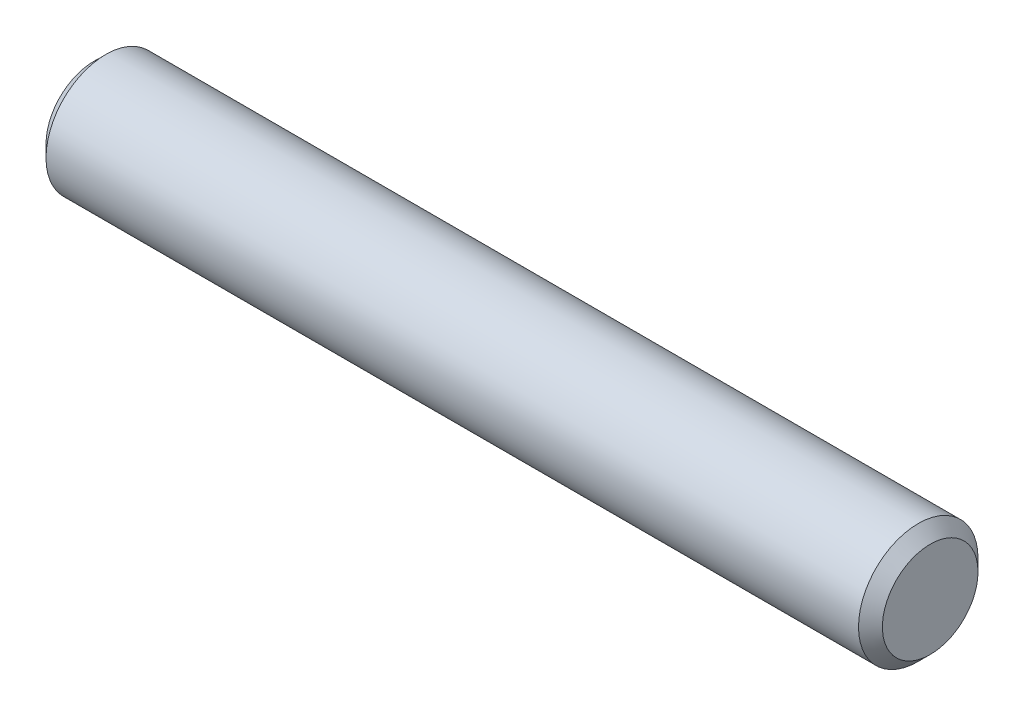
ISO-10303-21;
HEADER;
FILE_DESCRIPTION(('STEP AP214'),'2;1');
FILE_NAME('part.step','',(''),(''),'','','');
FILE_SCHEMA(('AUTOMOTIVE_DESIGN { 1 0 10303 214 1 1 1 1 }'));
ENDSEC;
DATA;
#1=APPLICATION_CONTEXT('core data for automotive mechanical design processes');
#2=APPLICATION_PROTOCOL_DEFINITION('international standard','automotive_design',2000,#1);
#3=PRODUCT_CONTEXT('',#1,'mechanical');
#4=PRODUCT('Part','Part','',(#3));
#5=PRODUCT_RELATED_PRODUCT_CATEGORY('part','',(#4));
#6=PRODUCT_DEFINITION_FORMATION('','',#4);
#7=PRODUCT_DEFINITION_CONTEXT('part definition',#1,'design');
#8=PRODUCT_DEFINITION('design','',#6,#7);
#9=PRODUCT_DEFINITION_SHAPE('','',#8);
#10=(LENGTH_UNIT() NAMED_UNIT(*) SI_UNIT(.MILLI.,.METRE.));
#11=(NAMED_UNIT(*) PLANE_ANGLE_UNIT() SI_UNIT($,.RADIAN.));
#12=(NAMED_UNIT(*) SI_UNIT($,.STERADIAN.) SOLID_ANGLE_UNIT());
#13=UNCERTAINTY_MEASURE_WITH_UNIT(LENGTH_MEASURE(1.E-05),#10,'distance_accuracy_value','');
#14=(GEOMETRIC_REPRESENTATION_CONTEXT(3) GLOBAL_UNCERTAINTY_ASSIGNED_CONTEXT((#13)) GLOBAL_UNIT_ASSIGNED_CONTEXT((#10,
#11,#12)) REPRESENTATION_CONTEXT('',''));
#15=CARTESIAN_POINT('',(0.,0.,0.));
#16=DIRECTION('',(0.,0.,1.));
#17=DIRECTION('',(1.,0.,0.));
#18=AXIS2_PLACEMENT_3D('',#15,#16,#17);
#19=CARTESIAN_POINT('',(22.225,0.,0.));
#20=DIRECTION('',(1.,0.,0.));
#21=DIRECTION('',(0.,1.,0.));
#22=AXIS2_PLACEMENT_3D('',#19,#20,#21);
#23=PLANE('',#22);
#24=CARTESIAN_POINT('',(22.225,0.,0.));
#25=DIRECTION('',(1.,0.,0.));
#26=DIRECTION('',(0.,0.,-1.));
#27=AXIS2_PLACEMENT_3D('',#24,#25,#26);
#28=CIRCLE('',#27,2.54);
#29=CARTESIAN_POINT('',(22.225,0.,-2.54));
#30=VERTEX_POINT('',#29);
#31=EDGE_CURVE('E25',#30,#30,#28,.T.);
#32=ORIENTED_EDGE('',*,*,#31,.T.);
#33=EDGE_LOOP('',(#32));
#34=FACE_BOUND('',#33,.T.);
#35=ADVANCED_FACE('F17',(#34),#23,.T.);
#36=CARTESIAN_POINT('',(-22.225,0.,0.));
#37=DIRECTION('',(1.,0.,0.));
#38=DIRECTION('',(0.,1.,0.));
#39=AXIS2_PLACEMENT_3D('',#36,#37,#38);
#40=PLANE('',#39);
#41=CARTESIAN_POINT('',(-22.225,0.,0.));
#42=DIRECTION('',(-1.,0.,0.));
#43=DIRECTION('',(0.,0.,-1.));
#44=AXIS2_PLACEMENT_3D('',#41,#42,#43);
#45=CIRCLE('',#44,2.54);
#46=CARTESIAN_POINT('',(-22.225,0.,2.54));
#47=VERTEX_POINT('',#46);
#48=EDGE_CURVE('E69',#47,#47,#45,.T.);
#49=ORIENTED_EDGE('',*,*,#48,.T.);
#50=EDGE_LOOP('',(#49));
#51=FACE_BOUND('',#50,.T.);
#52=ADVANCED_FACE('F136',(#51),#40,.F.);
#53=CARTESIAN_POINT('',(-22.225,0.,0.));
#54=DIRECTION('',(1.,0.,0.));
#55=DIRECTION('',(0.,0.,-1.));
#56=AXIS2_PLACEMENT_3D('',#53,#54,#55);
#57=CYLINDRICAL_SURFACE('',#56,3.175);
#58=CARTESIAN_POINT('',(21.59,0.,0.));
#59=DIRECTION('',(-1.,0.,0.));
#60=DIRECTION('',(0.,0.,-1.));
#61=AXIS2_PLACEMENT_3D('',#58,#59,#60);
#62=CIRCLE('',#61,3.175);
#63=CARTESIAN_POINT('',(21.59,0.,3.175));
#64=VERTEX_POINT('',#63);
#65=CARTESIAN_POINT('',(21.59,0.,-3.175));
#66=VERTEX_POINT('',#65);
#67=EDGE_CURVE('E77',#64,#66,#62,.T.);
#68=ORIENTED_EDGE('',*,*,#67,.T.);
#69=CARTESIAN_POINT('',(21.59,0.,0.));
#70=DIRECTION('',(-1.,0.,0.));
#71=DIRECTION('',(0.,0.,-1.));
#72=AXIS2_PLACEMENT_3D('',#69,#70,#71);
#73=CIRCLE('',#72,3.175);
#74=EDGE_CURVE('E63',#66,#64,#73,.T.);
#75=ORIENTED_EDGE('',*,*,#74,.T.);
#76=DIRECTION('',(-1.,0.,0.));
#77=VECTOR('',#76,1.);
#78=CARTESIAN_POINT('',(-22.225,0.,3.175));
#79=LINE('',#78,#77);
#80=CARTESIAN_POINT('',(-21.59,0.,3.175));
#81=VERTEX_POINT('',#80);
#82=EDGE_CURVE('E11',#64,#81,#79,.T.);
#83=ORIENTED_EDGE('',*,*,#82,.T.);
#84=CARTESIAN_POINT('',(-21.59,0.,0.));
#85=DIRECTION('',(1.,0.,0.));
#86=DIRECTION('',(0.,0.,-1.));
#87=AXIS2_PLACEMENT_3D('',#84,#85,#86);
#88=CIRCLE('',#87,3.175);
#89=EDGE_CURVE('E62',#81,#81,#88,.T.);
#90=ORIENTED_EDGE('',*,*,#89,.T.);
#91=ORIENTED_EDGE('',*,*,#82,.F.);
#92=EDGE_LOOP('',(#68,#75,#83,#90,#91));
#93=FACE_BOUND('',#92,.T.);
#94=ADVANCED_FACE('F60',(#93),#57,.T.);
#95=CARTESIAN_POINT('',(22.225,0.,0.));
#96=DIRECTION('',(-1.,0.,0.));
#97=DIRECTION('',(0.,0.,1.));
#98=AXIS2_PLACEMENT_3D('',#95,#96,#97);
#99=CONICAL_SURFACE('',#98,2.54,0.785398163397445);
#100=ORIENTED_EDGE('',*,*,#67,.F.);
#101=ORIENTED_EDGE('',*,*,#74,.F.);
#102=DIRECTION('',(0.70710678118655,0.,0.707106781186545));
#103=VECTOR('',#102,1.);
#104=CARTESIAN_POINT('',(22.225,0.,-2.54));
#105=LINE('',#104,#103);
#106=EDGE_CURVE('E42',#66,#30,#105,.T.);
#107=ORIENTED_EDGE('',*,*,#106,.T.);
#108=ORIENTED_EDGE('',*,*,#31,.F.);
#109=ORIENTED_EDGE('',*,*,#106,.F.);
#110=EDGE_LOOP('',(#100,#101,#107,#108,#109));
#111=FACE_BOUND('',#110,.T.);
#112=ADVANCED_FACE('F118',(#111),#99,.T.);
#113=CARTESIAN_POINT('',(-21.59,0.,0.));
#114=DIRECTION('',(1.,0.,0.));
#115=DIRECTION('',(0.,0.,-1.));
#116=AXIS2_PLACEMENT_3D('',#113,#114,#115);
#117=CONICAL_SURFACE('',#116,3.175,0.78539816339745);
#118=ORIENTED_EDGE('',*,*,#89,.F.);
#119=DIRECTION('',(-0.707106781186546,0.,-0.707106781186549));
#120=VECTOR('',#119,1.);
#121=CARTESIAN_POINT('',(-21.59,0.,3.175));
#122=LINE('',#121,#120);
#123=EDGE_CURVE('E67',#81,#47,#122,.T.);
#124=ORIENTED_EDGE('',*,*,#123,.T.);
#125=ORIENTED_EDGE('',*,*,#48,.F.);
#126=ORIENTED_EDGE('',*,*,#123,.F.);
#127=EDGE_LOOP('',(#118,#124,#125,#126));
#128=FACE_BOUND('',#127,.T.);
#129=ADVANCED_FACE('F68',(#128),#117,.T.);
#130=CLOSED_SHELL('',(#35,#52,#94,#112,#129));
#131=MANIFOLD_SOLID_BREP('B1',#130);
#132=ADVANCED_BREP_SHAPE_REPRESENTATION('',(#18,#131),#14);
#133=SHAPE_DEFINITION_REPRESENTATION(#9,#132);
ENDSEC;
END-ISO-10303-21;
